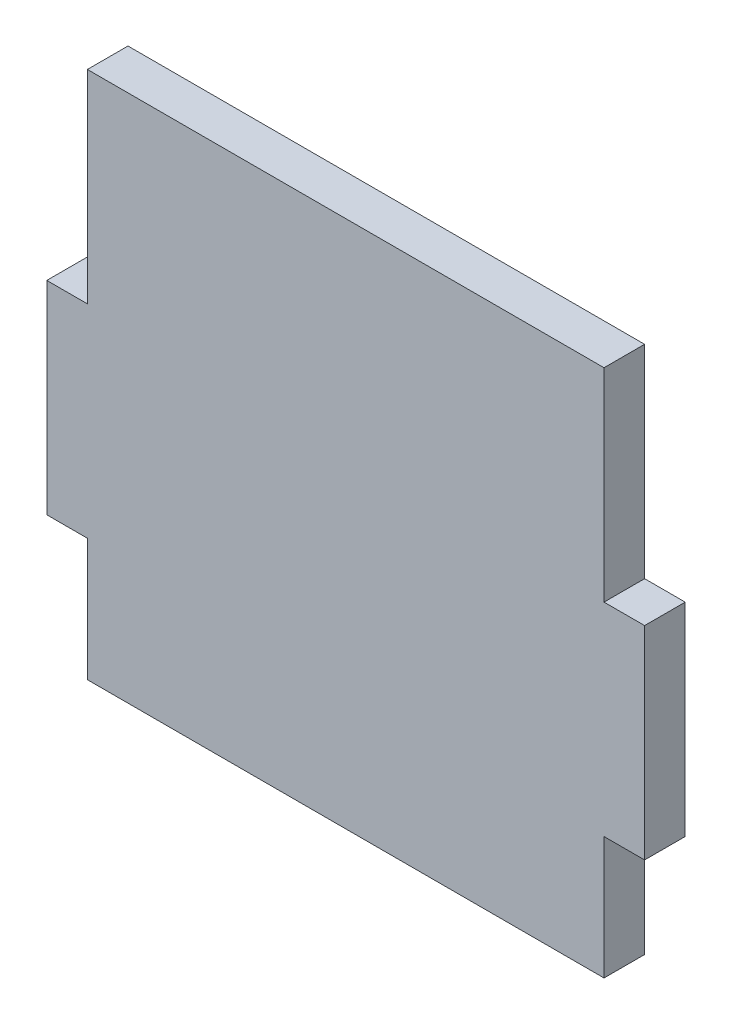
ISO-10303-21;
HEADER;
FILE_DESCRIPTION(('STEP AP214'),'2;1');
FILE_NAME('part.step','',(''),(''),'','','');
FILE_SCHEMA(('AUTOMOTIVE_DESIGN { 1 0 10303 214 1 1 1 1 }'));
ENDSEC;
DATA;
#1=APPLICATION_CONTEXT('core data for automotive mechanical design processes');
#2=APPLICATION_PROTOCOL_DEFINITION('international standard','automotive_design',2000,#1);
#3=PRODUCT_CONTEXT('',#1,'mechanical');
#4=PRODUCT('Part','Part','',(#3));
#5=PRODUCT_RELATED_PRODUCT_CATEGORY('part','',(#4));
#6=PRODUCT_DEFINITION_FORMATION('','',#4);
#7=PRODUCT_DEFINITION_CONTEXT('part definition',#1,'design');
#8=PRODUCT_DEFINITION('design','',#6,#7);
#9=PRODUCT_DEFINITION_SHAPE('','',#8);
#10=(LENGTH_UNIT() NAMED_UNIT(*) SI_UNIT(.MILLI.,.METRE.));
#11=(NAMED_UNIT(*) PLANE_ANGLE_UNIT() SI_UNIT($,.RADIAN.));
#12=(NAMED_UNIT(*) SI_UNIT($,.STERADIAN.) SOLID_ANGLE_UNIT());
#13=UNCERTAINTY_MEASURE_WITH_UNIT(LENGTH_MEASURE(1.E-05),#10,'distance_accuracy_value','');
#14=(GEOMETRIC_REPRESENTATION_CONTEXT(3) GLOBAL_UNCERTAINTY_ASSIGNED_CONTEXT((#13)) GLOBAL_UNIT_ASSIGNED_CONTEXT((#10,
#11,#12)) REPRESENTATION_CONTEXT('',''));
#15=CARTESIAN_POINT('',(0.,0.,0.));
#16=DIRECTION('',(0.,0.,1.));
#17=DIRECTION('',(1.,0.,0.));
#18=AXIS2_PLACEMENT_3D('',#15,#16,#17);
#19=CARTESIAN_POINT('',(-50.9,0.,4.));
#20=DIRECTION('',(1.,0.,0.));
#21=DIRECTION('',(0.,1.,0.));
#22=AXIS2_PLACEMENT_3D('',#19,#20,#21);
#23=PLANE('',#22);
#24=DIRECTION('',(0.,-1.,0.));
#25=VECTOR('',#24,1.);
#26=CARTESIAN_POINT('',(-50.9,0.,0.));
#27=LINE('',#26,#25);
#28=CARTESIAN_POINT('',(-50.9,-20.,0.));
#29=VERTEX_POINT('',#28);
#30=CARTESIAN_POINT('',(-50.9,-40.,0.));
#31=VERTEX_POINT('',#30);
#32=EDGE_CURVE('E152',#29,#31,#27,.T.);
#33=ORIENTED_EDGE('',*,*,#32,.T.);
#34=DIRECTION('',(0.,0.,-1.));
#35=VECTOR('',#34,1.);
#36=CARTESIAN_POINT('',(-50.9,-40.,4.));
#37=LINE('',#36,#35);
#38=CARTESIAN_POINT('',(-50.9,-40.,4.));
#39=VERTEX_POINT('',#38);
#40=EDGE_CURVE('E185',#39,#31,#37,.T.);
#41=ORIENTED_EDGE('',*,*,#40,.F.);
#42=DIRECTION('',(0.,-1.,0.));
#43=VECTOR('',#42,1.);
#44=CARTESIAN_POINT('',(-50.9,0.,4.));
#45=LINE('',#44,#43);
#46=CARTESIAN_POINT('',(-50.9,-20.,4.));
#47=VERTEX_POINT('',#46);
#48=EDGE_CURVE('E106',#47,#39,#45,.T.);
#49=ORIENTED_EDGE('',*,*,#48,.F.);
#50=DIRECTION('',(0.,0.,-1.));
#51=VECTOR('',#50,1.);
#52=CARTESIAN_POINT('',(-50.9,-20.,4.));
#53=LINE('',#52,#51);
#54=EDGE_CURVE('E45',#47,#29,#53,.T.);
#55=ORIENTED_EDGE('',*,*,#54,.T.);
#56=EDGE_LOOP('',(#33,#41,#49,#55));
#57=FACE_BOUND('',#56,.T.);
#58=ADVANCED_FACE('F37',(#57),#23,.F.);
#59=CARTESIAN_POINT('',(2.77555756156287E-13,-39.9999999999996,4.));
#60=DIRECTION('',(0.,-1.,0.));
#61=DIRECTION('',(1.,0.,0.));
#62=AXIS2_PLACEMENT_3D('',#59,#60,#61);
#63=PLANE('',#62);
#64=DIRECTION('',(-1.,0.,0.));
#65=VECTOR('',#64,1.);
#66=CARTESIAN_POINT('',(2.77555756156287E-13,-39.9999999999996,0.));
#67=LINE('',#66,#65);
#68=CARTESIAN_POINT('',(-54.9,-40.,0.));
#69=VERTEX_POINT('',#68);
#70=EDGE_CURVE('E154',#31,#69,#67,.T.);
#71=ORIENTED_EDGE('',*,*,#70,.T.);
#72=DIRECTION('',(0.,0.,-1.));
#73=VECTOR('',#72,1.);
#74=CARTESIAN_POINT('',(-54.9,-40.,4.));
#75=LINE('',#74,#73);
#76=CARTESIAN_POINT('',(-54.9,-40.,4.));
#77=VERTEX_POINT('',#76);
#78=EDGE_CURVE('E182',#77,#69,#75,.T.);
#79=ORIENTED_EDGE('',*,*,#78,.F.);
#80=DIRECTION('',(-1.,0.,0.));
#81=VECTOR('',#80,1.);
#82=CARTESIAN_POINT('',(2.77555756156287E-13,-39.9999999999996,4.));
#83=LINE('',#82,#81);
#84=EDGE_CURVE('E212',#39,#77,#83,.T.);
#85=ORIENTED_EDGE('',*,*,#84,.F.);
#86=ORIENTED_EDGE('',*,*,#40,.T.);
#87=EDGE_LOOP('',(#71,#79,#85,#86));
#88=FACE_BOUND('',#87,.T.);
#89=ADVANCED_FACE('F39',(#88),#63,.F.);
#90=CARTESIAN_POINT('',(-54.9,0.,4.));
#91=DIRECTION('',(1.,0.,0.));
#92=DIRECTION('',(0.,1.,0.));
#93=AXIS2_PLACEMENT_3D('',#90,#91,#92);
#94=PLANE('',#93);
#95=DIRECTION('',(0.,-1.,0.));
#96=VECTOR('',#95,1.);
#97=CARTESIAN_POINT('',(-54.9,0.,0.));
#98=LINE('',#97,#96);
#99=CARTESIAN_POINT('',(-54.9,-60.,0.));
#100=VERTEX_POINT('',#99);
#101=EDGE_CURVE('E158',#69,#100,#98,.T.);
#102=ORIENTED_EDGE('',*,*,#101,.T.);
#103=DIRECTION('',(0.,0.,-1.));
#104=VECTOR('',#103,1.);
#105=CARTESIAN_POINT('',(-54.9,-60.,4.));
#106=LINE('',#105,#104);
#107=CARTESIAN_POINT('',(-54.9,-60.,4.));
#108=VERTEX_POINT('',#107);
#109=EDGE_CURVE('E180',#108,#100,#106,.T.);
#110=ORIENTED_EDGE('',*,*,#109,.F.);
#111=DIRECTION('',(0.,-1.,0.));
#112=VECTOR('',#111,1.);
#113=CARTESIAN_POINT('',(-54.9,0.,4.));
#114=LINE('',#113,#112);
#115=EDGE_CURVE('E208',#77,#108,#114,.T.);
#116=ORIENTED_EDGE('',*,*,#115,.F.);
#117=ORIENTED_EDGE('',*,*,#78,.T.);
#118=EDGE_LOOP('',(#102,#110,#116,#117));
#119=FACE_BOUND('',#118,.T.);
#120=ADVANCED_FACE('F206',(#119),#94,.F.);
#121=CARTESIAN_POINT('',(1.04083408558608E-13,-59.9999999999999,4.));
#122=DIRECTION('',(0.,-1.,0.));
#123=DIRECTION('',(1.,0.,0.));
#124=AXIS2_PLACEMENT_3D('',#121,#122,#123);
#125=PLANE('',#124);
#126=DIRECTION('',(-1.,0.,0.));
#127=VECTOR('',#126,1.);
#128=CARTESIAN_POINT('',(1.04083408558608E-13,-59.9999999999999,0.));
#129=LINE('',#128,#127);
#130=CARTESIAN_POINT('',(-50.9,-60.,0.));
#131=VERTEX_POINT('',#130);
#132=EDGE_CURVE('E161',#131,#100,#129,.T.);
#133=ORIENTED_EDGE('',*,*,#132,.F.);
#134=DIRECTION('',(0.,0.,-1.));
#135=VECTOR('',#134,1.);
#136=CARTESIAN_POINT('',(-50.9,-60.,4.));
#137=LINE('',#136,#135);
#138=CARTESIAN_POINT('',(-50.9,-60.,4.));
#139=VERTEX_POINT('',#138);
#140=EDGE_CURVE('E178',#139,#131,#137,.T.);
#141=ORIENTED_EDGE('',*,*,#140,.F.);
#142=DIRECTION('',(-1.,0.,0.));
#143=VECTOR('',#142,1.);
#144=CARTESIAN_POINT('',(1.04083408558608E-13,-59.9999999999999,4.));
#145=LINE('',#144,#143);
#146=EDGE_CURVE('E211',#139,#108,#145,.T.);
#147=ORIENTED_EDGE('',*,*,#146,.T.);
#148=ORIENTED_EDGE('',*,*,#109,.T.);
#149=EDGE_LOOP('',(#133,#141,#147,#148));
#150=FACE_BOUND('',#149,.T.);
#151=ADVANCED_FACE('F259',(#150),#125,.T.);
#152=CARTESIAN_POINT('',(-50.9,-72.0715728752536,0.));
#153=VERTEX_POINT('',#152);
#154=EDGE_CURVE('E156',#131,#153,#27,.T.);
#155=ORIENTED_EDGE('',*,*,#154,.T.);
#156=DIRECTION('',(0.,0.,-1.));
#157=VECTOR('',#156,1.);
#158=CARTESIAN_POINT('',(-50.9,-72.0715728752536,10.));
#159=LINE('',#158,#157);
#160=CARTESIAN_POINT('',(-50.9,-72.0715728752536,4.));
#161=VERTEX_POINT('',#160);
#162=EDGE_CURVE('E52',#161,#153,#159,.T.);
#163=ORIENTED_EDGE('',*,*,#162,.F.);
#164=EDGE_CURVE('E214',#139,#161,#45,.T.);
#165=ORIENTED_EDGE('',*,*,#164,.F.);
#166=ORIENTED_EDGE('',*,*,#140,.T.);
#167=EDGE_LOOP('',(#155,#163,#165,#166));
#168=FACE_BOUND('',#167,.T.);
#169=ADVANCED_FACE('F252',(#168),#23,.F.);
#170=CARTESIAN_POINT('',(0.,0.,4.));
#171=DIRECTION('',(1.,0.,0.));
#172=DIRECTION('',(0.,1.,0.));
#173=AXIS2_PLACEMENT_3D('',#170,#171,#172);
#174=PLANE('',#173);
#175=DIRECTION('',(0.,0.,1.));
#176=VECTOR('',#175,1.);
#177=CARTESIAN_POINT('',(0.,-72.0715728752536,4.));
#178=LINE('',#177,#176);
#179=CARTESIAN_POINT('',(0.,-72.0715728752536,0.));
#180=VERTEX_POINT('',#179);
#181=CARTESIAN_POINT('',(0.,-72.0715728752536,4.));
#182=VERTEX_POINT('',#181);
#183=EDGE_CURVE('E233',#180,#182,#178,.T.);
#184=ORIENTED_EDGE('',*,*,#183,.F.);
#185=DIRECTION('',(0.,-1.,0.));
#186=VECTOR('',#185,1.);
#187=CARTESIAN_POINT('',(0.,0.,0.));
#188=LINE('',#187,#186);
#189=CARTESIAN_POINT('',(0.,-60.,0.));
#190=VERTEX_POINT('',#189);
#191=EDGE_CURVE('E164',#190,#180,#188,.T.);
#192=ORIENTED_EDGE('',*,*,#191,.F.);
#193=DIRECTION('',(0.,0.,-1.));
#194=VECTOR('',#193,1.);
#195=CARTESIAN_POINT('',(0.,-60.,4.));
#196=LINE('',#195,#194);
#197=CARTESIAN_POINT('',(0.,-60.,4.));
#198=VERTEX_POINT('',#197);
#199=EDGE_CURVE('E142',#198,#190,#196,.T.);
#200=ORIENTED_EDGE('',*,*,#199,.F.);
#201=DIRECTION('',(0.,-1.,0.));
#202=VECTOR('',#201,1.);
#203=CARTESIAN_POINT('',(0.,0.,4.));
#204=LINE('',#203,#202);
#205=EDGE_CURVE('E131',#198,#182,#204,.T.);
#206=ORIENTED_EDGE('',*,*,#205,.T.);
#207=EDGE_LOOP('',(#184,#192,#200,#206));
#208=FACE_BOUND('',#207,.T.);
#209=ADVANCED_FACE('F238',(#208),#174,.T.);
#210=CARTESIAN_POINT('',(-1.04083408558608E-13,-60.,4.));
#211=DIRECTION('',(0.,1.,0.));
#212=DIRECTION('',(-1.,0.,0.));
#213=AXIS2_PLACEMENT_3D('',#210,#211,#212);
#214=PLANE('',#213);
#215=DIRECTION('',(1.,0.,0.));
#216=VECTOR('',#215,1.);
#217=CARTESIAN_POINT('',(-1.04083408558608E-13,-60.,0.));
#218=LINE('',#217,#216);
#219=CARTESIAN_POINT('',(4.,-60.,0.));
#220=VERTEX_POINT('',#219);
#221=EDGE_CURVE('E138',#190,#220,#218,.T.);
#222=ORIENTED_EDGE('',*,*,#221,.T.);
#223=DIRECTION('',(0.,0.,-1.));
#224=VECTOR('',#223,1.);
#225=CARTESIAN_POINT('',(4.,-60.,4.));
#226=LINE('',#225,#224);
#227=CARTESIAN_POINT('',(4.,-60.,4.));
#228=VERTEX_POINT('',#227);
#229=EDGE_CURVE('E135',#228,#220,#226,.T.);
#230=ORIENTED_EDGE('',*,*,#229,.F.);
#231=DIRECTION('',(1.,0.,0.));
#232=VECTOR('',#231,1.);
#233=CARTESIAN_POINT('',(-1.04083408558608E-13,-60.,4.));
#234=LINE('',#233,#232);
#235=EDGE_CURVE('E124',#198,#228,#234,.T.);
#236=ORIENTED_EDGE('',*,*,#235,.F.);
#237=ORIENTED_EDGE('',*,*,#199,.T.);
#238=EDGE_LOOP('',(#222,#230,#236,#237));
#239=FACE_BOUND('',#238,.T.);
#240=ADVANCED_FACE('F136',(#239),#214,.F.);
#241=CARTESIAN_POINT('',(3.99999999999998,0.,4.));
#242=DIRECTION('',(1.,0.,0.));
#243=DIRECTION('',(0.,1.,0.));
#244=AXIS2_PLACEMENT_3D('',#241,#242,#243);
#245=PLANE('',#244);
#246=DIRECTION('',(0.,-1.,0.));
#247=VECTOR('',#246,1.);
#248=CARTESIAN_POINT('',(3.99999999999998,0.,0.));
#249=LINE('',#248,#247);
#250=CARTESIAN_POINT('',(4.,-40.,0.));
#251=VERTEX_POINT('',#250);
#252=EDGE_CURVE('E169',#251,#220,#249,.T.);
#253=ORIENTED_EDGE('',*,*,#252,.F.);
#254=DIRECTION('',(0.,0.,-1.));
#255=VECTOR('',#254,1.);
#256=CARTESIAN_POINT('',(4.,-40.,4.));
#257=LINE('',#256,#255);
#258=CARTESIAN_POINT('',(4.,-40.,4.));
#259=VERTEX_POINT('',#258);
#260=EDGE_CURVE('E143',#259,#251,#257,.T.);
#261=ORIENTED_EDGE('',*,*,#260,.F.);
#262=DIRECTION('',(0.,-1.,0.));
#263=VECTOR('',#262,1.);
#264=CARTESIAN_POINT('',(3.99999999999998,0.,4.));
#265=LINE('',#264,#263);
#266=EDGE_CURVE('E129',#259,#228,#265,.T.);
#267=ORIENTED_EDGE('',*,*,#266,.T.);
#268=ORIENTED_EDGE('',*,*,#229,.T.);
#269=EDGE_LOOP('',(#253,#261,#267,#268));
#270=FACE_BOUND('',#269,.T.);
#271=ADVANCED_FACE('F145',(#270),#245,.T.);
#272=CARTESIAN_POINT('',(-2.77555756156289E-13,-40.,4.));
#273=DIRECTION('',(0.,1.,0.));
#274=DIRECTION('',(-1.,0.,0.));
#275=AXIS2_PLACEMENT_3D('',#272,#273,#274);
#276=PLANE('',#275);
#277=DIRECTION('',(1.,0.,0.));
#278=VECTOR('',#277,1.);
#279=CARTESIAN_POINT('',(-2.77555756156289E-13,-40.,0.));
#280=LINE('',#279,#278);
#281=CARTESIAN_POINT('',(0.,-40.,0.));
#282=VERTEX_POINT('',#281);
#283=EDGE_CURVE('E171',#282,#251,#280,.T.);
#284=ORIENTED_EDGE('',*,*,#283,.F.);
#285=DIRECTION('',(0.,0.,-1.));
#286=VECTOR('',#285,1.);
#287=CARTESIAN_POINT('',(0.,-40.,4.));
#288=LINE('',#287,#286);
#289=CARTESIAN_POINT('',(0.,-40.,4.));
#290=VERTEX_POINT('',#289);
#291=EDGE_CURVE('E61',#290,#282,#288,.T.);
#292=ORIENTED_EDGE('',*,*,#291,.F.);
#293=DIRECTION('',(1.,0.,0.));
#294=VECTOR('',#293,1.);
#295=CARTESIAN_POINT('',(-2.77555756156289E-13,-40.,4.));
#296=LINE('',#295,#294);
#297=EDGE_CURVE('E146',#290,#259,#296,.T.);
#298=ORIENTED_EDGE('',*,*,#297,.T.);
#299=ORIENTED_EDGE('',*,*,#260,.T.);
#300=EDGE_LOOP('',(#284,#292,#298,#299));
#301=FACE_BOUND('',#300,.T.);
#302=ADVANCED_FACE('F241',(#301),#276,.T.);
#303=CARTESIAN_POINT('',(0.,-20.,0.));
#304=VERTEX_POINT('',#303);
#305=EDGE_CURVE('E167',#304,#282,#188,.T.);
#306=ORIENTED_EDGE('',*,*,#305,.F.);
#307=DIRECTION('',(0.,0.,-1.));
#308=VECTOR('',#307,1.);
#309=CARTESIAN_POINT('',(0.,-20.,4.));
#310=LINE('',#309,#308);
#311=CARTESIAN_POINT('',(0.,-20.,4.));
#312=VERTEX_POINT('',#311);
#313=EDGE_CURVE('E98',#312,#304,#310,.T.);
#314=ORIENTED_EDGE('',*,*,#313,.F.);
#315=EDGE_CURVE('E148',#312,#290,#204,.T.);
#316=ORIENTED_EDGE('',*,*,#315,.T.);
#317=ORIENTED_EDGE('',*,*,#291,.T.);
#318=EDGE_LOOP('',(#306,#314,#316,#317));
#319=FACE_BOUND('',#318,.T.);
#320=ADVANCED_FACE('F224',(#319),#174,.T.);
#321=CARTESIAN_POINT('',(0.,0.,4.));
#322=DIRECTION('',(0.,0.,1.));
#323=DIRECTION('',(1.,0.,0.));
#324=AXIS2_PLACEMENT_3D('',#321,#322,#323);
#325=PLANE('',#324);
#326=DIRECTION('',(-1.,0.,0.));
#327=VECTOR('',#326,1.);
#328=CARTESIAN_POINT('',(0.,-72.0715728752536,4.));
#329=LINE('',#328,#327);
#330=EDGE_CURVE('E239',#182,#161,#329,.T.);
#331=ORIENTED_EDGE('',*,*,#330,.F.);
#332=ORIENTED_EDGE('',*,*,#205,.F.);
#333=ORIENTED_EDGE('',*,*,#235,.T.);
#334=ORIENTED_EDGE('',*,*,#266,.F.);
#335=ORIENTED_EDGE('',*,*,#297,.F.);
#336=ORIENTED_EDGE('',*,*,#315,.F.);
#337=DIRECTION('',(-1.,0.,0.));
#338=VECTOR('',#337,1.);
#339=CARTESIAN_POINT('',(-54.9,-20.,4.));
#340=LINE('',#339,#338);
#341=EDGE_CURVE('E155',#312,#47,#340,.T.);
#342=ORIENTED_EDGE('',*,*,#341,.T.);
#343=ORIENTED_EDGE('',*,*,#48,.T.);
#344=ORIENTED_EDGE('',*,*,#84,.T.);
#345=ORIENTED_EDGE('',*,*,#115,.T.);
#346=ORIENTED_EDGE('',*,*,#146,.F.);
#347=ORIENTED_EDGE('',*,*,#164,.T.);
#348=EDGE_LOOP('',(#331,#332,#333,#334,#335,#336,#342,#343,#344,#345,#346,#347));
#349=FACE_BOUND('',#348,.T.);
#350=ADVANCED_FACE('F127',(#349),#325,.T.);
#351=CARTESIAN_POINT('',(0.,0.,0.));
#352=DIRECTION('',(0.,0.,1.));
#353=DIRECTION('',(1.,0.,0.));
#354=AXIS2_PLACEMENT_3D('',#351,#352,#353);
#355=PLANE('',#354);
#356=ORIENTED_EDGE('',*,*,#191,.T.);
#357=DIRECTION('',(1.,0.,0.));
#358=VECTOR('',#357,1.);
#359=CARTESIAN_POINT('',(-50.9,-72.0715728752536,0.));
#360=LINE('',#359,#358);
#361=EDGE_CURVE('E231',#153,#180,#360,.T.);
#362=ORIENTED_EDGE('',*,*,#361,.F.);
#363=ORIENTED_EDGE('',*,*,#154,.F.);
#364=ORIENTED_EDGE('',*,*,#132,.T.);
#365=ORIENTED_EDGE('',*,*,#101,.F.);
#366=ORIENTED_EDGE('',*,*,#70,.F.);
#367=ORIENTED_EDGE('',*,*,#32,.F.);
#368=DIRECTION('',(1.,0.,0.));
#369=VECTOR('',#368,1.);
#370=CARTESIAN_POINT('',(0.,-20.,0.));
#371=LINE('',#370,#369);
#372=EDGE_CURVE('E11',#29,#304,#371,.T.);
#373=ORIENTED_EDGE('',*,*,#372,.T.);
#374=ORIENTED_EDGE('',*,*,#305,.T.);
#375=ORIENTED_EDGE('',*,*,#283,.T.);
#376=ORIENTED_EDGE('',*,*,#252,.T.);
#377=ORIENTED_EDGE('',*,*,#221,.F.);
#378=EDGE_LOOP('',(#356,#362,#363,#364,#365,#366,#367,#373,#374,#375,#376,#377));
#379=FACE_BOUND('',#378,.T.);
#380=ADVANCED_FACE('F197',(#379),#355,.F.);
#381=CARTESIAN_POINT('',(-54.9,-20.,4.));
#382=DIRECTION('',(0.,-1.,0.));
#383=DIRECTION('',(0.,0.,-1.));
#384=AXIS2_PLACEMENT_3D('',#381,#382,#383);
#385=PLANE('',#384);
#386=ORIENTED_EDGE('',*,*,#341,.F.);
#387=ORIENTED_EDGE('',*,*,#313,.T.);
#388=ORIENTED_EDGE('',*,*,#372,.F.);
#389=ORIENTED_EDGE('',*,*,#54,.F.);
#390=EDGE_LOOP('',(#386,#387,#388,#389));
#391=FACE_BOUND('',#390,.T.);
#392=ADVANCED_FACE('F376',(#391),#385,.F.);
#393=CARTESIAN_POINT('',(-50.9,-72.0715728752536,10.));
#394=DIRECTION('',(0.,1.,0.));
#395=DIRECTION('',(-1.,0.,0.));
#396=AXIS2_PLACEMENT_3D('',#393,#394,#395);
#397=PLANE('',#396);
#398=ORIENTED_EDGE('',*,*,#183,.T.);
#399=ORIENTED_EDGE('',*,*,#330,.T.);
#400=ORIENTED_EDGE('',*,*,#162,.T.);
#401=ORIENTED_EDGE('',*,*,#361,.T.);
#402=EDGE_LOOP('',(#398,#399,#400,#401));
#403=FACE_BOUND('',#402,.T.);
#404=ADVANCED_FACE('F232',(#403),#397,.F.);
#405=CLOSED_SHELL('',(#58,#89,#120,#151,#169,#209,#240,#271,#302,#320,#350,#380,#392,#404));
#406=MANIFOLD_SOLID_BREP('B2',#405);
#407=ADVANCED_BREP_SHAPE_REPRESENTATION('',(#18,#406),#14);
#408=SHAPE_DEFINITION_REPRESENTATION(#9,#407);
ENDSEC;
END-ISO-10303-21;
